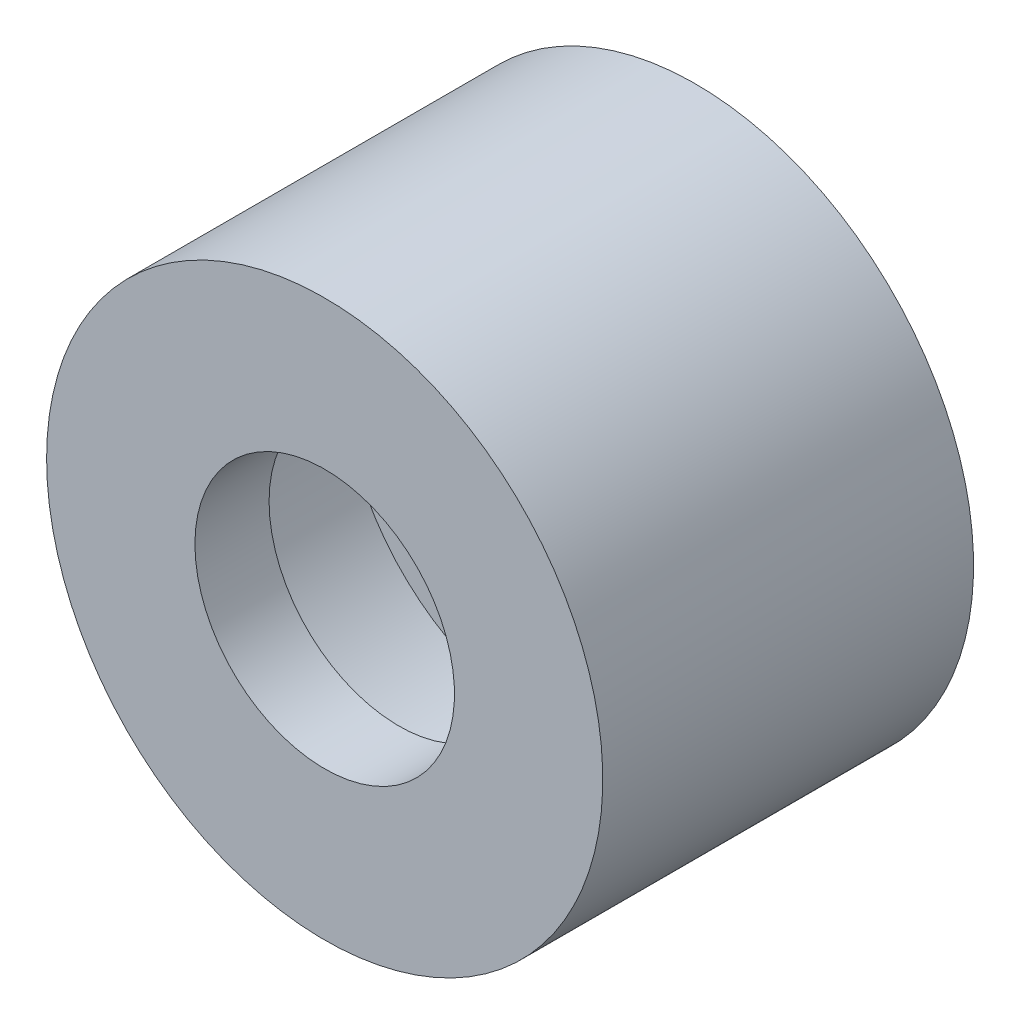
ISO-10303-21;
HEADER;
FILE_DESCRIPTION(('STEP AP214'),'2;1');
FILE_NAME('part.step','',(''),(''),'','','');
FILE_SCHEMA(('AUTOMOTIVE_DESIGN { 1 0 10303 214 1 1 1 1 }'));
ENDSEC;
DATA;
#1=APPLICATION_CONTEXT('core data for automotive mechanical design processes');
#2=APPLICATION_PROTOCOL_DEFINITION('international standard','automotive_design',2000,#1);
#3=PRODUCT_CONTEXT('',#1,'mechanical');
#4=PRODUCT('Part','Part','',(#3));
#5=PRODUCT_RELATED_PRODUCT_CATEGORY('part','',(#4));
#6=PRODUCT_DEFINITION_FORMATION('','',#4);
#7=PRODUCT_DEFINITION_CONTEXT('part definition',#1,'design');
#8=PRODUCT_DEFINITION('design','',#6,#7);
#9=PRODUCT_DEFINITION_SHAPE('','',#8);
#10=(LENGTH_UNIT() NAMED_UNIT(*) SI_UNIT(.MILLI.,.METRE.));
#11=(NAMED_UNIT(*) PLANE_ANGLE_UNIT() SI_UNIT($,.RADIAN.));
#12=(NAMED_UNIT(*) SI_UNIT($,.STERADIAN.) SOLID_ANGLE_UNIT());
#13=UNCERTAINTY_MEASURE_WITH_UNIT(LENGTH_MEASURE(1.E-05),#10,'distance_accuracy_value','');
#14=(GEOMETRIC_REPRESENTATION_CONTEXT(3) GLOBAL_UNCERTAINTY_ASSIGNED_CONTEXT((#13)) GLOBAL_UNIT_ASSIGNED_CONTEXT((#10,
#11,#12)) REPRESENTATION_CONTEXT('',''));
#15=CARTESIAN_POINT('',(0.,0.,0.));
#16=DIRECTION('',(0.,0.,1.));
#17=DIRECTION('',(1.,0.,0.));
#18=AXIS2_PLACEMENT_3D('',#15,#16,#17);
#19=CARTESIAN_POINT('',(0.,0.,-17.1869834710744));
#20=DIRECTION('',(0.,0.,-1.));
#21=DIRECTION('',(-1.,0.,0.));
#22=AXIS2_PLACEMENT_3D('',#19,#20,#21);
#23=CYLINDRICAL_SURFACE('',#22,5.55625);
#24=CARTESIAN_POINT('',(0.,0.,0.));
#25=DIRECTION('',(0.,0.,-1.));
#26=DIRECTION('',(-1.,0.,0.));
#27=AXIS2_PLACEMENT_3D('',#24,#25,#26);
#28=CIRCLE('',#27,5.55625);
#29=CARTESIAN_POINT('',(-5.55625,0.,0.));
#30=VERTEX_POINT('',#29);
#31=EDGE_CURVE('E65',#30,#30,#28,.T.);
#32=ORIENTED_EDGE('',*,*,#31,.F.);
#33=EDGE_LOOP('',(#32));
#34=FACE_BOUND('',#33,.T.);
#35=CARTESIAN_POINT('',(0.,0.,-3.175));
#36=DIRECTION('',(0.,0.,-1.));
#37=DIRECTION('',(-1.,0.,0.));
#38=AXIS2_PLACEMENT_3D('',#35,#36,#37);
#39=CIRCLE('',#38,5.55625);
#40=CARTESIAN_POINT('',(-5.55625,0.,-3.175));
#41=VERTEX_POINT('',#40);
#42=EDGE_CURVE('E10',#41,#41,#39,.T.);
#43=ORIENTED_EDGE('',*,*,#42,.T.);
#44=EDGE_LOOP('',(#43));
#45=FACE_BOUND('',#44,.T.);
#46=ADVANCED_FACE('F31',(#34,#45),#23,.F.);
#47=CARTESIAN_POINT('',(5.55625,0.,-3.175));
#48=DIRECTION('',(0.,0.,1.));
#49=DIRECTION('',(1.,0.,0.));
#50=AXIS2_PLACEMENT_3D('',#47,#48,#49);
#51=PLANE('',#50);
#52=ORIENTED_EDGE('',*,*,#42,.F.);
#53=EDGE_LOOP('',(#52));
#54=FACE_BOUND('',#53,.T.);
#55=CARTESIAN_POINT('',(0.,0.,-3.175));
#56=DIRECTION('',(0.,0.,-1.));
#57=DIRECTION('',(-1.,0.,0.));
#58=AXIS2_PLACEMENT_3D('',#55,#56,#57);
#59=CIRCLE('',#58,8.73125);
#60=CARTESIAN_POINT('',(-8.73125,0.,-3.175));
#61=VERTEX_POINT('',#60);
#62=EDGE_CURVE('E37',#61,#61,#59,.T.);
#63=ORIENTED_EDGE('',*,*,#62,.T.);
#64=EDGE_LOOP('',(#63));
#65=FACE_BOUND('',#64,.T.);
#66=ADVANCED_FACE('F72',(#54,#65),#51,.F.);
#67=CARTESIAN_POINT('',(0.,0.,-17.1869834710744));
#68=DIRECTION('',(0.,0.,-1.));
#69=DIRECTION('',(-1.,0.,0.));
#70=AXIS2_PLACEMENT_3D('',#67,#68,#69);
#71=CYLINDRICAL_SURFACE('',#70,8.73125);
#72=ORIENTED_EDGE('',*,*,#62,.F.);
#73=EDGE_LOOP('',(#72));
#74=FACE_BOUND('',#73,.T.);
#75=CARTESIAN_POINT('',(0.,0.,-9.525));
#76=DIRECTION('',(0.,0.,-1.));
#77=DIRECTION('',(-1.,0.,0.));
#78=AXIS2_PLACEMENT_3D('',#75,#76,#77);
#79=CIRCLE('',#78,8.73125);
#80=CARTESIAN_POINT('',(-8.73125,0.,-9.525));
#81=VERTEX_POINT('',#80);
#82=EDGE_CURVE('E41',#81,#81,#79,.T.);
#83=ORIENTED_EDGE('',*,*,#82,.T.);
#84=EDGE_LOOP('',(#83));
#85=FACE_BOUND('',#84,.T.);
#86=ADVANCED_FACE('F76',(#74,#85),#71,.F.);
#87=CARTESIAN_POINT('',(8.73125,0.,-9.525));
#88=DIRECTION('',(0.,0.,-1.));
#89=DIRECTION('',(-1.,0.,0.));
#90=AXIS2_PLACEMENT_3D('',#87,#88,#89);
#91=PLANE('',#90);
#92=ORIENTED_EDGE('',*,*,#82,.F.);
#93=EDGE_LOOP('',(#92));
#94=FACE_BOUND('',#93,.T.);
#95=CARTESIAN_POINT('',(0.,0.,-9.525));
#96=DIRECTION('',(0.,0.,-1.));
#97=DIRECTION('',(-1.,0.,0.));
#98=AXIS2_PLACEMENT_3D('',#95,#96,#97);
#99=CIRCLE('',#98,5.55625);
#100=CARTESIAN_POINT('',(-5.55625,0.,-9.525));
#101=VERTEX_POINT('',#100);
#102=EDGE_CURVE('E45',#101,#101,#99,.T.);
#103=ORIENTED_EDGE('',*,*,#102,.T.);
#104=EDGE_LOOP('',(#103));
#105=FACE_BOUND('',#104,.T.);
#106=ADVANCED_FACE('F81',(#94,#105),#91,.F.);
#107=CARTESIAN_POINT('',(0.,0.,-17.1869834710744));
#108=DIRECTION('',(0.,0.,-1.));
#109=DIRECTION('',(-1.,0.,0.));
#110=AXIS2_PLACEMENT_3D('',#107,#108,#109);
#111=CYLINDRICAL_SURFACE('',#110,5.55625);
#112=ORIENTED_EDGE('',*,*,#102,.F.);
#113=EDGE_LOOP('',(#112));
#114=FACE_BOUND('',#113,.T.);
#115=CARTESIAN_POINT('',(0.,0.,-12.7));
#116=DIRECTION('',(0.,0.,-1.));
#117=DIRECTION('',(-1.,0.,0.));
#118=AXIS2_PLACEMENT_3D('',#115,#116,#117);
#119=CIRCLE('',#118,5.55625);
#120=CARTESIAN_POINT('',(-5.55625,0.,-12.7));
#121=VERTEX_POINT('',#120);
#122=EDGE_CURVE('E50',#121,#121,#119,.T.);
#123=ORIENTED_EDGE('',*,*,#122,.T.);
#124=EDGE_LOOP('',(#123));
#125=FACE_BOUND('',#124,.T.);
#126=ADVANCED_FACE('F87',(#114,#125),#111,.F.);
#127=CARTESIAN_POINT('',(5.55625,0.,-12.7));
#128=DIRECTION('',(0.,0.,1.));
#129=DIRECTION('',(1.,0.,0.));
#130=AXIS2_PLACEMENT_3D('',#127,#128,#129);
#131=PLANE('',#130);
#132=ORIENTED_EDGE('',*,*,#122,.F.);
#133=EDGE_LOOP('',(#132));
#134=FACE_BOUND('',#133,.T.);
#135=CARTESIAN_POINT('',(0.,0.,-12.7));
#136=DIRECTION('',(0.,0.,-1.));
#137=DIRECTION('',(-1.,0.,0.));
#138=AXIS2_PLACEMENT_3D('',#135,#136,#137);
#139=CIRCLE('',#138,8.73125);
#140=CARTESIAN_POINT('',(-8.73125,0.,-12.7));
#141=VERTEX_POINT('',#140);
#142=EDGE_CURVE('E53',#141,#141,#139,.T.);
#143=ORIENTED_EDGE('',*,*,#142,.T.);
#144=EDGE_LOOP('',(#143));
#145=FACE_BOUND('',#144,.T.);
#146=ADVANCED_FACE('F91',(#134,#145),#131,.F.);
#147=CARTESIAN_POINT('',(0.,0.,-17.1869834710744));
#148=DIRECTION('',(0.,0.,-1.));
#149=DIRECTION('',(-1.,0.,0.));
#150=AXIS2_PLACEMENT_3D('',#147,#148,#149);
#151=CYLINDRICAL_SURFACE('',#150,8.73125);
#152=ORIENTED_EDGE('',*,*,#142,.F.);
#153=EDGE_LOOP('',(#152));
#154=FACE_BOUND('',#153,.T.);
#155=CARTESIAN_POINT('',(0.,0.,-15.875));
#156=DIRECTION('',(0.,0.,-1.));
#157=DIRECTION('',(-1.,0.,0.));
#158=AXIS2_PLACEMENT_3D('',#155,#156,#157);
#159=CIRCLE('',#158,8.73125);
#160=CARTESIAN_POINT('',(-8.73125,0.,-15.875));
#161=VERTEX_POINT('',#160);
#162=EDGE_CURVE('E56',#161,#161,#159,.T.);
#163=ORIENTED_EDGE('',*,*,#162,.T.);
#164=EDGE_LOOP('',(#163));
#165=FACE_BOUND('',#164,.T.);
#166=ADVANCED_FACE('F95',(#154,#165),#151,.F.);
#167=CARTESIAN_POINT('',(8.73125,0.,-15.875));
#168=DIRECTION('',(0.,0.,1.));
#169=DIRECTION('',(1.,0.,0.));
#170=AXIS2_PLACEMENT_3D('',#167,#168,#169);
#171=PLANE('',#170);
#172=ORIENTED_EDGE('',*,*,#162,.F.);
#173=EDGE_LOOP('',(#172));
#174=FACE_BOUND('',#173,.T.);
#175=CARTESIAN_POINT('',(0.,0.,-15.875));
#176=DIRECTION('',(0.,0.,-1.));
#177=DIRECTION('',(-1.,0.,0.));
#178=AXIS2_PLACEMENT_3D('',#175,#176,#177);
#179=CIRCLE('',#178,11.90625);
#180=CARTESIAN_POINT('',(-11.90625,0.,-15.875));
#181=VERTEX_POINT('',#180);
#182=EDGE_CURVE('E59',#181,#181,#179,.T.);
#183=ORIENTED_EDGE('',*,*,#182,.T.);
#184=EDGE_LOOP('',(#183));
#185=FACE_BOUND('',#184,.T.);
#186=ADVANCED_FACE('F99',(#174,#185),#171,.F.);
#187=CARTESIAN_POINT('',(0.,0.,-17.1869834710744));
#188=DIRECTION('',(0.,0.,-1.));
#189=DIRECTION('',(-1.,0.,0.));
#190=AXIS2_PLACEMENT_3D('',#187,#188,#189);
#191=CYLINDRICAL_SURFACE('',#190,11.90625);
#192=ORIENTED_EDGE('',*,*,#182,.F.);
#193=EDGE_LOOP('',(#192));
#194=FACE_BOUND('',#193,.T.);
#195=CARTESIAN_POINT('',(0.,0.,0.));
#196=DIRECTION('',(0.,0.,-1.));
#197=DIRECTION('',(-1.,0.,0.));
#198=AXIS2_PLACEMENT_3D('',#195,#196,#197);
#199=CIRCLE('',#198,11.90625);
#200=CARTESIAN_POINT('',(-11.90625,0.,0.));
#201=VERTEX_POINT('',#200);
#202=EDGE_CURVE('E62',#201,#201,#199,.T.);
#203=ORIENTED_EDGE('',*,*,#202,.T.);
#204=EDGE_LOOP('',(#203));
#205=FACE_BOUND('',#204,.T.);
#206=ADVANCED_FACE('F103',(#194,#205),#191,.T.);
#207=CARTESIAN_POINT('',(5.55625,0.,0.));
#208=DIRECTION('',(0.,0.,-1.));
#209=DIRECTION('',(-1.,0.,0.));
#210=AXIS2_PLACEMENT_3D('',#207,#208,#209);
#211=PLANE('',#210);
#212=ORIENTED_EDGE('',*,*,#202,.F.);
#213=EDGE_LOOP('',(#212));
#214=FACE_BOUND('',#213,.T.);
#215=ORIENTED_EDGE('',*,*,#31,.T.);
#216=EDGE_LOOP('',(#215));
#217=FACE_BOUND('',#216,.T.);
#218=ADVANCED_FACE('F69',(#214,#217),#211,.F.);
#219=CLOSED_SHELL('',(#46,#66,#86,#106,#126,#146,#166,#186,#206,#218));
#220=MANIFOLD_SOLID_BREP('B2',#219);
#221=ADVANCED_BREP_SHAPE_REPRESENTATION('',(#18,#220),#14);
#222=SHAPE_DEFINITION_REPRESENTATION(#9,#221);
ENDSEC;
END-ISO-10303-21;
